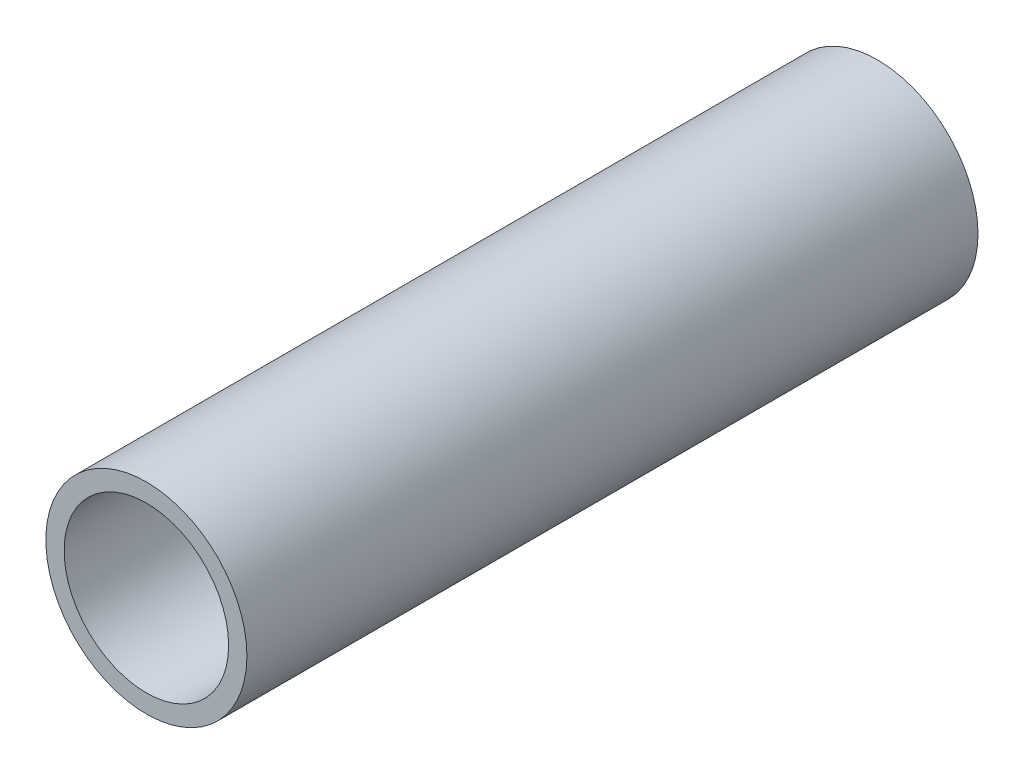
ISO-10303-21;
HEADER;
FILE_DESCRIPTION(('STEP AP214'),'2;1');
FILE_NAME('part.step','',(''),(''),'','','');
FILE_SCHEMA(('AUTOMOTIVE_DESIGN { 1 0 10303 214 1 1 1 1 }'));
ENDSEC;
DATA;
#1=APPLICATION_CONTEXT('core data for automotive mechanical design processes');
#2=APPLICATION_PROTOCOL_DEFINITION('international standard','automotive_design',2000,#1);
#3=PRODUCT_CONTEXT('',#1,'mechanical');
#4=PRODUCT('Part','Part','',(#3));
#5=PRODUCT_RELATED_PRODUCT_CATEGORY('part','',(#4));
#6=PRODUCT_DEFINITION_FORMATION('','',#4);
#7=PRODUCT_DEFINITION_CONTEXT('part definition',#1,'design');
#8=PRODUCT_DEFINITION('design','',#6,#7);
#9=PRODUCT_DEFINITION_SHAPE('','',#8);
#10=(LENGTH_UNIT() NAMED_UNIT(*) SI_UNIT(.MILLI.,.METRE.));
#11=(NAMED_UNIT(*) PLANE_ANGLE_UNIT() SI_UNIT($,.RADIAN.));
#12=(NAMED_UNIT(*) SI_UNIT($,.STERADIAN.) SOLID_ANGLE_UNIT());
#13=UNCERTAINTY_MEASURE_WITH_UNIT(LENGTH_MEASURE(1.E-05),#10,'distance_accuracy_value','');
#14=(GEOMETRIC_REPRESENTATION_CONTEXT(3) GLOBAL_UNCERTAINTY_ASSIGNED_CONTEXT((#13)) GLOBAL_UNIT_ASSIGNED_CONTEXT((#10,
#11,#12)) REPRESENTATION_CONTEXT('',''));
#15=CARTESIAN_POINT('',(0.,0.,0.));
#16=DIRECTION('',(0.,0.,1.));
#17=DIRECTION('',(1.,0.,0.));
#18=AXIS2_PLACEMENT_3D('',#15,#16,#17);
#19=CARTESIAN_POINT('',(0.,9.,40.));
#20=DIRECTION('',(0.,0.,-1.));
#21=DIRECTION('',(-1.,0.,0.));
#22=AXIS2_PLACEMENT_3D('',#19,#20,#21);
#23=PLANE('',#22);
#24=CARTESIAN_POINT('',(0.,0.,40.));
#25=DIRECTION('',(0.,0.,1.));
#26=DIRECTION('',(1.,0.,0.));
#27=AXIS2_PLACEMENT_3D('',#24,#25,#26);
#28=CIRCLE('',#27,9.);
#29=CARTESIAN_POINT('',(9.,0.,40.));
#30=VERTEX_POINT('',#29);
#31=EDGE_CURVE('E54',#30,#30,#28,.T.);
#32=ORIENTED_EDGE('',*,*,#31,.F.);
#33=EDGE_LOOP('',(#32));
#34=FACE_BOUND('',#33,.T.);
#35=CARTESIAN_POINT('',(0.,0.,40.));
#36=DIRECTION('',(0.,0.,1.));
#37=DIRECTION('',(1.,0.,0.));
#38=AXIS2_PLACEMENT_3D('',#35,#36,#37);
#39=CIRCLE('',#38,11.);
#40=CARTESIAN_POINT('',(11.,0.,40.));
#41=VERTEX_POINT('',#40);
#42=EDGE_CURVE('E10',#41,#41,#39,.T.);
#43=ORIENTED_EDGE('',*,*,#42,.T.);
#44=EDGE_LOOP('',(#43));
#45=FACE_BOUND('',#44,.T.);
#46=ADVANCED_FACE('F37',(#34,#45),#23,.F.);
#47=CARTESIAN_POINT('',(0.,0.,0.));
#48=DIRECTION('',(0.,0.,1.));
#49=DIRECTION('',(1.,0.,0.));
#50=AXIS2_PLACEMENT_3D('',#47,#48,#49);
#51=CYLINDRICAL_SURFACE('',#50,11.);
#52=ORIENTED_EDGE('',*,*,#42,.F.);
#53=EDGE_LOOP('',(#52));
#54=FACE_BOUND('',#53,.T.);
#55=CARTESIAN_POINT('',(0.,0.,-40.));
#56=DIRECTION('',(0.,0.,1.));
#57=DIRECTION('',(1.,0.,0.));
#58=AXIS2_PLACEMENT_3D('',#55,#56,#57);
#59=CIRCLE('',#58,11.);
#60=CARTESIAN_POINT('',(11.,0.,-40.));
#61=VERTEX_POINT('',#60);
#62=EDGE_CURVE('E44',#61,#61,#59,.T.);
#63=ORIENTED_EDGE('',*,*,#62,.T.);
#64=EDGE_LOOP('',(#63));
#65=FACE_BOUND('',#64,.T.);
#66=ADVANCED_FACE('F64',(#54,#65),#51,.T.);
#67=CARTESIAN_POINT('',(0.,9.,-40.));
#68=DIRECTION('',(0.,0.,1.));
#69=DIRECTION('',(1.,0.,0.));
#70=AXIS2_PLACEMENT_3D('',#67,#68,#69);
#71=PLANE('',#70);
#72=ORIENTED_EDGE('',*,*,#62,.F.);
#73=EDGE_LOOP('',(#72));
#74=FACE_BOUND('',#73,.T.);
#75=CARTESIAN_POINT('',(0.,0.,-40.));
#76=DIRECTION('',(0.,0.,1.));
#77=DIRECTION('',(1.,0.,0.));
#78=AXIS2_PLACEMENT_3D('',#75,#76,#77);
#79=CIRCLE('',#78,9.);
#80=CARTESIAN_POINT('',(9.,0.,-40.));
#81=VERTEX_POINT('',#80);
#82=EDGE_CURVE('E49',#81,#81,#79,.T.);
#83=ORIENTED_EDGE('',*,*,#82,.T.);
#84=EDGE_LOOP('',(#83));
#85=FACE_BOUND('',#84,.T.);
#86=ADVANCED_FACE('F68',(#74,#85),#71,.F.);
#87=CARTESIAN_POINT('',(0.,0.,0.));
#88=DIRECTION('',(0.,0.,1.));
#89=DIRECTION('',(1.,0.,0.));
#90=AXIS2_PLACEMENT_3D('',#87,#88,#89);
#91=CYLINDRICAL_SURFACE('',#90,9.);
#92=ORIENTED_EDGE('',*,*,#82,.F.);
#93=EDGE_LOOP('',(#92));
#94=FACE_BOUND('',#93,.T.);
#95=ORIENTED_EDGE('',*,*,#31,.T.);
#96=EDGE_LOOP('',(#95));
#97=FACE_BOUND('',#96,.T.);
#98=ADVANCED_FACE('F61',(#94,#97),#91,.F.);
#99=CLOSED_SHELL('',(#46,#66,#86,#98));
#100=MANIFOLD_SOLID_BREP('B2',#99);
#101=ADVANCED_BREP_SHAPE_REPRESENTATION('',(#18,#100),#14);
#102=SHAPE_DEFINITION_REPRESENTATION(#9,#101);
ENDSEC;
END-ISO-10303-21;
